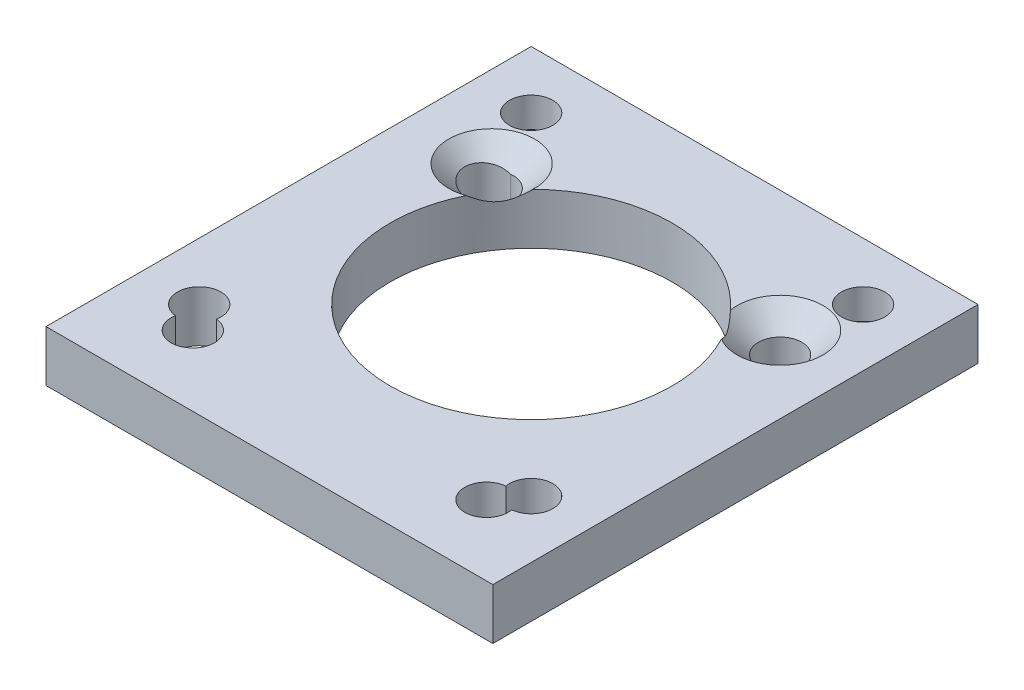
ISO-10303-21;
HEADER;
FILE_DESCRIPTION(('STEP AP214'),'2;1');
FILE_NAME('part.step','',(''),(''),'','','');
FILE_SCHEMA(('AUTOMOTIVE_DESIGN { 1 0 10303 214 1 1 1 1 }'));
ENDSEC;
DATA;
#1=APPLICATION_CONTEXT('core data for automotive mechanical design processes');
#2=APPLICATION_PROTOCOL_DEFINITION('international standard','automotive_design',2000,#1);
#3=PRODUCT_CONTEXT('',#1,'mechanical');
#4=PRODUCT('Part','Part','',(#3));
#5=PRODUCT_RELATED_PRODUCT_CATEGORY('part','',(#4));
#6=PRODUCT_DEFINITION_FORMATION('','',#4);
#7=PRODUCT_DEFINITION_CONTEXT('part definition',#1,'design');
#8=PRODUCT_DEFINITION('design','',#6,#7);
#9=PRODUCT_DEFINITION_SHAPE('','',#8);
#10=(LENGTH_UNIT() NAMED_UNIT(*) SI_UNIT(.MILLI.,.METRE.));
#11=(NAMED_UNIT(*) PLANE_ANGLE_UNIT() SI_UNIT($,.RADIAN.));
#12=(NAMED_UNIT(*) SI_UNIT($,.STERADIAN.) SOLID_ANGLE_UNIT());
#13=UNCERTAINTY_MEASURE_WITH_UNIT(LENGTH_MEASURE(1.E-05),#10,'distance_accuracy_value','');
#14=(GEOMETRIC_REPRESENTATION_CONTEXT(3) GLOBAL_UNCERTAINTY_ASSIGNED_CONTEXT((#13)) GLOBAL_UNIT_ASSIGNED_CONTEXT((#10,
#11,#12)) REPRESENTATION_CONTEXT('',''));
#15=CARTESIAN_POINT('',(0.,0.,0.));
#16=DIRECTION('',(0.,0.,1.));
#17=DIRECTION('',(1.,0.,0.));
#18=AXIS2_PLACEMENT_3D('',#15,#16,#17);
#19=CARTESIAN_POINT('',(17.5,4.,19.));
#20=DIRECTION('',(-1.,0.,0.));
#21=DIRECTION('',(0.,0.,1.));
#22=AXIS2_PLACEMENT_3D('',#19,#20,#21);
#23=PLANE('',#22);
#24=DIRECTION('',(0.,0.,-1.));
#25=VECTOR('',#24,1.);
#26=CARTESIAN_POINT('',(17.5,0.,19.));
#27=LINE('',#26,#25);
#28=CARTESIAN_POINT('',(17.5,0.,19.));
#29=VERTEX_POINT('',#28);
#30=CARTESIAN_POINT('',(17.5,0.,-19.));
#31=VERTEX_POINT('',#30);
#32=EDGE_CURVE('E208',#29,#31,#27,.T.);
#33=ORIENTED_EDGE('',*,*,#32,.T.);
#34=DIRECTION('',(0.,-1.,0.));
#35=VECTOR('',#34,1.);
#36=CARTESIAN_POINT('',(17.5,4.,-19.));
#37=LINE('',#36,#35);
#38=CARTESIAN_POINT('',(17.5,4.,-19.));
#39=VERTEX_POINT('',#38);
#40=EDGE_CURVE('E246',#39,#31,#37,.T.);
#41=ORIENTED_EDGE('',*,*,#40,.F.);
#42=DIRECTION('',(0.,0.,-1.));
#43=VECTOR('',#42,1.);
#44=CARTESIAN_POINT('',(17.5,4.,19.));
#45=LINE('',#44,#43);
#46=CARTESIAN_POINT('',(17.5,4.,19.));
#47=VERTEX_POINT('',#46);
#48=EDGE_CURVE('E209',#47,#39,#45,.T.);
#49=ORIENTED_EDGE('',*,*,#48,.F.);
#50=DIRECTION('',(0.,-1.,0.));
#51=VECTOR('',#50,1.);
#52=CARTESIAN_POINT('',(17.5,4.,19.));
#53=LINE('',#52,#51);
#54=EDGE_CURVE('E223',#47,#29,#53,.T.);
#55=ORIENTED_EDGE('',*,*,#54,.T.);
#56=EDGE_LOOP('',(#33,#41,#49,#55));
#57=FACE_BOUND('',#56,.T.);
#58=ADVANCED_FACE('F41',(#57),#23,.F.);
#59=CARTESIAN_POINT('',(-17.5,4.,-19.));
#60=DIRECTION('',(0.,0.,1.));
#61=DIRECTION('',(1.,0.,0.));
#62=AXIS2_PLACEMENT_3D('',#59,#60,#61);
#63=PLANE('',#62);
#64=DIRECTION('',(-1.,0.,0.));
#65=VECTOR('',#64,1.);
#66=CARTESIAN_POINT('',(-17.5,0.,-19.));
#67=LINE('',#66,#65);
#68=CARTESIAN_POINT('',(-17.5,0.,-19.));
#69=VERTEX_POINT('',#68);
#70=EDGE_CURVE('E227',#31,#69,#67,.T.);
#71=ORIENTED_EDGE('',*,*,#70,.T.);
#72=DIRECTION('',(0.,-1.,0.));
#73=VECTOR('',#72,1.);
#74=CARTESIAN_POINT('',(-17.5,4.,-19.));
#75=LINE('',#74,#73);
#76=CARTESIAN_POINT('',(-17.5,4.,-19.));
#77=VERTEX_POINT('',#76);
#78=EDGE_CURVE('E242',#77,#69,#75,.T.);
#79=ORIENTED_EDGE('',*,*,#78,.F.);
#80=DIRECTION('',(-1.,0.,0.));
#81=VECTOR('',#80,1.);
#82=CARTESIAN_POINT('',(-17.5,4.,-19.));
#83=LINE('',#82,#81);
#84=EDGE_CURVE('E213',#39,#77,#83,.T.);
#85=ORIENTED_EDGE('',*,*,#84,.F.);
#86=ORIENTED_EDGE('',*,*,#40,.T.);
#87=EDGE_LOOP('',(#71,#79,#85,#86));
#88=FACE_BOUND('',#87,.T.);
#89=ADVANCED_FACE('F317',(#88),#63,.F.);
#90=CARTESIAN_POINT('',(-17.5,4.,19.));
#91=DIRECTION('',(1.,0.,0.));
#92=DIRECTION('',(0.,0.,-1.));
#93=AXIS2_PLACEMENT_3D('',#90,#91,#92);
#94=PLANE('',#93);
#95=DIRECTION('',(0.,0.,1.));
#96=VECTOR('',#95,1.);
#97=CARTESIAN_POINT('',(-17.5,0.,19.));
#98=LINE('',#97,#96);
#99=CARTESIAN_POINT('',(-17.5,0.,19.));
#100=VERTEX_POINT('',#99);
#101=EDGE_CURVE('E230',#69,#100,#98,.T.);
#102=ORIENTED_EDGE('',*,*,#101,.T.);
#103=DIRECTION('',(0.,-1.,0.));
#104=VECTOR('',#103,1.);
#105=CARTESIAN_POINT('',(-17.5,4.,19.));
#106=LINE('',#105,#104);
#107=CARTESIAN_POINT('',(-17.5,4.,19.));
#108=VERTEX_POINT('',#107);
#109=EDGE_CURVE('E238',#108,#100,#106,.T.);
#110=ORIENTED_EDGE('',*,*,#109,.F.);
#111=DIRECTION('',(0.,0.,1.));
#112=VECTOR('',#111,1.);
#113=CARTESIAN_POINT('',(-17.5,4.,19.));
#114=LINE('',#113,#112);
#115=EDGE_CURVE('E217',#77,#108,#114,.T.);
#116=ORIENTED_EDGE('',*,*,#115,.F.);
#117=ORIENTED_EDGE('',*,*,#78,.T.);
#118=EDGE_LOOP('',(#102,#110,#116,#117));
#119=FACE_BOUND('',#118,.T.);
#120=ADVANCED_FACE('F314',(#119),#94,.F.);
#121=CARTESIAN_POINT('',(-17.5,4.,19.));
#122=DIRECTION('',(0.,0.,-1.));
#123=DIRECTION('',(-1.,0.,0.));
#124=AXIS2_PLACEMENT_3D('',#121,#122,#123);
#125=PLANE('',#124);
#126=DIRECTION('',(1.,0.,0.));
#127=VECTOR('',#126,1.);
#128=CARTESIAN_POINT('',(-17.5,0.,19.));
#129=LINE('',#128,#127);
#130=EDGE_CURVE('E214',#100,#29,#129,.T.);
#131=ORIENTED_EDGE('',*,*,#130,.T.);
#132=ORIENTED_EDGE('',*,*,#54,.F.);
#133=DIRECTION('',(1.,0.,0.));
#134=VECTOR('',#133,1.);
#135=CARTESIAN_POINT('',(-17.5,4.,19.));
#136=LINE('',#135,#134);
#137=EDGE_CURVE('E220',#108,#47,#136,.T.);
#138=ORIENTED_EDGE('',*,*,#137,.F.);
#139=ORIENTED_EDGE('',*,*,#109,.T.);
#140=EDGE_LOOP('',(#131,#132,#138,#139));
#141=FACE_BOUND('',#140,.T.);
#142=ADVANCED_FACE('F307',(#141),#125,.F.);
#143=CARTESIAN_POINT('',(0.,4.,0.));
#144=DIRECTION('',(0.,-1.,0.));
#145=DIRECTION('',(0.,0.,-1.));
#146=AXIS2_PLACEMENT_3D('',#143,#144,#145);
#147=PLANE('',#146);
#148=CARTESIAN_POINT('',(-13.,4.,-14.5));
#149=DIRECTION('',(0.,1.,0.));
#150=DIRECTION('',(0.,0.,1.));
#151=AXIS2_PLACEMENT_3D('',#148,#149,#150);
#152=CIRCLE('',#151,1.69999999999999);
#153=CARTESIAN_POINT('',(-13.,4.,-12.8));
#154=VERTEX_POINT('',#153);
#155=EDGE_CURVE('E551',#154,#154,#152,.T.);
#156=ORIENTED_EDGE('',*,*,#155,.F.);
#157=EDGE_LOOP('',(#156));
#158=FACE_BOUND('',#157,.T.);
#159=CARTESIAN_POINT('',(13.,4.,-14.5));
#160=DIRECTION('',(0.,1.,0.));
#161=DIRECTION('',(0.,0.,1.));
#162=AXIS2_PLACEMENT_3D('',#159,#160,#161);
#163=CIRCLE('',#162,1.69999999999999);
#164=CARTESIAN_POINT('',(13.,4.,-12.8));
#165=VERTEX_POINT('',#164);
#166=EDGE_CURVE('E547',#165,#165,#163,.T.);
#167=ORIENTED_EDGE('',*,*,#166,.F.);
#168=EDGE_LOOP('',(#167));
#169=FACE_BOUND('',#168,.T.);
#170=CARTESIAN_POINT('',(0.,4.,-1.5));
#171=DIRECTION('',(0.,1.,0.));
#172=DIRECTION('',(0.,0.,1.));
#173=AXIS2_PLACEMENT_3D('',#170,#171,#172);
#174=CIRCLE('',#173,11.05);
#175=CARTESIAN_POINT('',(8.19098442890587,4.,-8.91689113344811));
#176=VERTEX_POINT('',#175);
#177=CARTESIAN_POINT('',(-7.73496340737816,4.,-9.39131428131724));
#178=VERTEX_POINT('',#177);
#179=EDGE_CURVE('E166',#176,#178,#174,.T.);
#180=ORIENTED_EDGE('',*,*,#179,.F.);
#181=CARTESIAN_POINT('',(11.5000000000009,4.,-9.4999999999995));
#182=DIRECTION('',(0.,1.,0.));
#183=DIRECTION('',(0.,0.,1.));
#184=AXIS2_PLACEMENT_3D('',#181,#182,#183);
#185=CIRCLE('',#184,3.36);
#186=CARTESIAN_POINT('',(9.80251034816513,4.,-6.6003226245126));
#187=VERTEX_POINT('',#186);
#188=EDGE_CURVE('E64',#187,#176,#185,.T.);
#189=ORIENTED_EDGE('',*,*,#188,.F.);
#190=CARTESIAN_POINT('',(-9.92979890441477,4.,-6.34784423407806));
#191=VERTEX_POINT('',#190);
#192=EDGE_CURVE('E165',#191,#187,#174,.T.);
#193=ORIENTED_EDGE('',*,*,#192,.F.);
#194=CARTESIAN_POINT('',(-11.0932051221084,4.,-9.4999999999995));
#195=DIRECTION('',(0.,1.,0.));
#196=DIRECTION('',(0.,0.,1.));
#197=AXIS2_PLACEMENT_3D('',#194,#195,#196);
#198=CIRCLE('',#197,3.36);
#199=EDGE_CURVE('E495',#178,#191,#198,.T.);
#200=ORIENTED_EDGE('',*,*,#199,.F.);
#201=EDGE_LOOP('',(#180,#189,#193,#200));
#202=FACE_BOUND('',#201,.T.);
#203=CARTESIAN_POINT('',(11.5000000000009,4.,13.5000000000005));
#204=DIRECTION('',(0.,-1.,0.));
#205=DIRECTION('',(0.,0.,-1.));
#206=AXIS2_PLACEMENT_3D('',#203,#204,#205);
#207=CIRCLE('',#206,1.7);
#208=CARTESIAN_POINT('',(13.171737489745,4.,13.1913031173081));
#209=VERTEX_POINT('',#208);
#210=CARTESIAN_POINT('',(11.3282625102559,4.,11.8086968826924));
#211=VERTEX_POINT('',#210);
#212=EDGE_CURVE('E188',#209,#211,#207,.T.);
#213=ORIENTED_EDGE('',*,*,#212,.T.);
#214=CARTESIAN_POINT('',(13.,4.,11.5));
#215=DIRECTION('',(0.,1.,0.));
#216=DIRECTION('',(0.,0.,1.));
#217=AXIS2_PLACEMENT_3D('',#214,#215,#216);
#218=CIRCLE('',#217,1.69999999999999);
#219=EDGE_CURVE('E527',#209,#211,#218,.T.);
#220=ORIENTED_EDGE('',*,*,#219,.F.);
#221=EDGE_LOOP('',(#213,#220));
#222=FACE_BOUND('',#221,.T.);
#223=CARTESIAN_POINT('',(-11.4999999999991,4.,13.5000000000005));
#224=DIRECTION('',(0.,-1.,0.));
#225=DIRECTION('',(0.,0.,-1.));
#226=AXIS2_PLACEMENT_3D('',#223,#224,#225);
#227=CIRCLE('',#226,1.7);
#228=CARTESIAN_POINT('',(-11.3282625102559,4.,11.8086968826922));
#229=VERTEX_POINT('',#228);
#230=CARTESIAN_POINT('',(-13.1717374897433,4.,13.1913031173083));
#231=VERTEX_POINT('',#230);
#232=EDGE_CURVE('E204',#229,#231,#227,.T.);
#233=ORIENTED_EDGE('',*,*,#232,.T.);
#234=CARTESIAN_POINT('',(-13.,4.,11.5));
#235=DIRECTION('',(0.,1.,0.));
#236=DIRECTION('',(0.,0.,1.));
#237=AXIS2_PLACEMENT_3D('',#234,#235,#236);
#238=CIRCLE('',#237,1.69999999999999);
#239=EDGE_CURVE('E544',#229,#231,#238,.T.);
#240=ORIENTED_EDGE('',*,*,#239,.F.);
#241=EDGE_LOOP('',(#233,#240));
#242=FACE_BOUND('',#241,.T.);
#243=ORIENTED_EDGE('',*,*,#48,.T.);
#244=ORIENTED_EDGE('',*,*,#84,.T.);
#245=ORIENTED_EDGE('',*,*,#115,.T.);
#246=ORIENTED_EDGE('',*,*,#137,.T.);
#247=EDGE_LOOP('',(#243,#244,#245,#246));
#248=FACE_BOUND('',#247,.T.);
#249=ADVANCED_FACE('F162',(#158,#169,#202,#222,#242,#248),#147,.F.);
#250=CARTESIAN_POINT('',(0.,0.,0.));
#251=DIRECTION('',(0.,-1.,0.));
#252=DIRECTION('',(0.,0.,-1.));
#253=AXIS2_PLACEMENT_3D('',#250,#251,#252);
#254=PLANE('',#253);
#255=CARTESIAN_POINT('',(-11.0932051221084,0.,-9.4999999999995));
#256=DIRECTION('',(0.,1.,0.));
#257=DIRECTION('',(0.,0.,1.));
#258=AXIS2_PLACEMENT_3D('',#255,#256,#257);
#259=CIRCLE('',#258,1.7);
#260=CARTESIAN_POINT('',(-11.2966025610538,0.,-7.81221165964682));
#261=VERTEX_POINT('',#260);
#262=CARTESIAN_POINT('',(-11.2966025610537,0.,-11.1877883403522));
#263=VERTEX_POINT('',#262);
#264=EDGE_CURVE('E290',#261,#263,#259,.T.);
#265=ORIENTED_EDGE('',*,*,#264,.T.);
#266=CARTESIAN_POINT('',(-11.4999999999991,0.,-9.49999999999951));
#267=DIRECTION('',(0.,-1.,0.));
#268=DIRECTION('',(0.,0.,-1.));
#269=AXIS2_PLACEMENT_3D('',#266,#267,#268);
#270=CIRCLE('',#269,1.7);
#271=EDGE_CURVE('E196',#261,#263,#270,.T.);
#272=ORIENTED_EDGE('',*,*,#271,.F.);
#273=EDGE_LOOP('',(#265,#272));
#274=FACE_BOUND('',#273,.T.);
#275=CARTESIAN_POINT('',(13.,0.,-14.5));
#276=DIRECTION('',(0.,-1.,0.));
#277=DIRECTION('',(0.,0.,-1.));
#278=AXIS2_PLACEMENT_3D('',#275,#276,#277);
#279=CIRCLE('',#278,3.36);
#280=CARTESIAN_POINT('',(13.,0.,-17.86));
#281=VERTEX_POINT('',#280);
#282=EDGE_CURVE('E289',#281,#281,#279,.T.);
#283=ORIENTED_EDGE('',*,*,#282,.F.);
#284=EDGE_LOOP('',(#283));
#285=FACE_BOUND('',#284,.T.);
#286=CARTESIAN_POINT('',(-13.,0.,-14.5));
#287=DIRECTION('',(0.,-1.,0.));
#288=DIRECTION('',(0.,0.,-1.));
#289=AXIS2_PLACEMENT_3D('',#286,#287,#288);
#290=CIRCLE('',#289,3.36);
#291=CARTESIAN_POINT('',(-13.,0.,-17.86));
#292=VERTEX_POINT('',#291);
#293=EDGE_CURVE('E514',#292,#292,#290,.T.);
#294=ORIENTED_EDGE('',*,*,#293,.F.);
#295=EDGE_LOOP('',(#294));
#296=FACE_BOUND('',#295,.T.);
#297=CARTESIAN_POINT('',(-13.,0.,11.5));
#298=DIRECTION('',(0.,1.,0.));
#299=DIRECTION('',(0.,0.,1.));
#300=AXIS2_PLACEMENT_3D('',#297,#298,#299);
#301=CIRCLE('',#300,1.7);
#302=CARTESIAN_POINT('',(-11.3282625102559,0.,11.8086968826922));
#303=VERTEX_POINT('',#302);
#304=CARTESIAN_POINT('',(-13.1717374897433,0.,13.1913031173083));
#305=VERTEX_POINT('',#304);
#306=EDGE_CURVE('E518',#303,#305,#301,.T.);
#307=ORIENTED_EDGE('',*,*,#306,.T.);
#308=CARTESIAN_POINT('',(-11.4999999999991,0.,13.5000000000005));
#309=DIRECTION('',(0.,-1.,0.));
#310=DIRECTION('',(0.,0.,-1.));
#311=AXIS2_PLACEMENT_3D('',#308,#309,#310);
#312=CIRCLE('',#311,1.7);
#313=EDGE_CURVE('E200',#303,#305,#312,.T.);
#314=ORIENTED_EDGE('',*,*,#313,.F.);
#315=EDGE_LOOP('',(#307,#314));
#316=FACE_BOUND('',#315,.T.);
#317=CARTESIAN_POINT('',(13.,0.,11.5));
#318=DIRECTION('',(0.,1.,0.));
#319=DIRECTION('',(0.,0.,1.));
#320=AXIS2_PLACEMENT_3D('',#317,#318,#319);
#321=CIRCLE('',#320,1.7);
#322=CARTESIAN_POINT('',(13.171737489745,0.,13.1913031173081));
#323=VERTEX_POINT('',#322);
#324=CARTESIAN_POINT('',(11.3282625102559,0.,11.8086968826924));
#325=VERTEX_POINT('',#324);
#326=EDGE_CURVE('E182',#323,#325,#321,.T.);
#327=ORIENTED_EDGE('',*,*,#326,.T.);
#328=CARTESIAN_POINT('',(11.5000000000009,0.,13.5000000000005));
#329=DIRECTION('',(0.,-1.,0.));
#330=DIRECTION('',(0.,0.,-1.));
#331=AXIS2_PLACEMENT_3D('',#328,#329,#330);
#332=CIRCLE('',#331,1.7);
#333=EDGE_CURVE('E179',#323,#325,#332,.T.);
#334=ORIENTED_EDGE('',*,*,#333,.F.);
#335=EDGE_LOOP('',(#327,#334));
#336=FACE_BOUND('',#335,.T.);
#337=CARTESIAN_POINT('',(0.,0.,-1.5));
#338=DIRECTION('',(0.,1.,0.));
#339=DIRECTION('',(0.,0.,1.));
#340=AXIS2_PLACEMENT_3D('',#337,#338,#339);
#341=CIRCLE('',#340,11.05);
#342=CARTESIAN_POINT('',(0.,0.,9.55));
#343=VERTEX_POINT('',#342);
#344=EDGE_CURVE('E175',#343,#343,#341,.T.);
#345=ORIENTED_EDGE('',*,*,#344,.T.);
#346=EDGE_LOOP('',(#345));
#347=FACE_BOUND('',#346,.T.);
#348=CARTESIAN_POINT('',(11.5000000000009,0.,-9.4999999999995));
#349=DIRECTION('',(0.,-1.,0.));
#350=DIRECTION('',(0.,0.,-1.));
#351=AXIS2_PLACEMENT_3D('',#348,#349,#350);
#352=CIRCLE('',#351,1.7);
#353=CARTESIAN_POINT('',(11.5000000000009,0.,-11.1999999999995));
#354=VERTEX_POINT('',#353);
#355=EDGE_CURVE('E192',#354,#354,#352,.T.);
#356=ORIENTED_EDGE('',*,*,#355,.F.);
#357=EDGE_LOOP('',(#356));
#358=FACE_BOUND('',#357,.T.);
#359=ORIENTED_EDGE('',*,*,#32,.F.);
#360=ORIENTED_EDGE('',*,*,#130,.F.);
#361=ORIENTED_EDGE('',*,*,#101,.F.);
#362=ORIENTED_EDGE('',*,*,#70,.F.);
#363=EDGE_LOOP('',(#359,#360,#361,#362));
#364=FACE_BOUND('',#363,.T.);
#365=ADVANCED_FACE('F303',(#274,#285,#296,#316,#336,#347,#358,#364),#254,.T.);
#366=CARTESIAN_POINT('',(-11.4999999999991,0.,13.5000000000005));
#367=DIRECTION('',(0.,-1.,0.));
#368=DIRECTION('',(0.,0.,-1.));
#369=AXIS2_PLACEMENT_3D('',#366,#367,#368);
#370=CYLINDRICAL_SURFACE('',#369,1.7);
#371=ORIENTED_EDGE('',*,*,#232,.F.);
#372=DIRECTION('',(0.,1.,0.));
#373=VECTOR('',#372,1.);
#374=CARTESIAN_POINT('',(-11.3282625102559,2.,11.8086968826922));
#375=LINE('',#374,#373);
#376=EDGE_CURVE('E532',#229,#303,#375,.F.);
#377=ORIENTED_EDGE('',*,*,#376,.T.);
#378=ORIENTED_EDGE('',*,*,#313,.T.);
#379=DIRECTION('',(0.,1.,0.));
#380=VECTOR('',#379,1.);
#381=CARTESIAN_POINT('',(-13.1717374897433,2.,13.1913031173083));
#382=LINE('',#381,#380);
#383=EDGE_CURVE('E536',#305,#231,#382,.T.);
#384=ORIENTED_EDGE('',*,*,#383,.T.);
#385=EDGE_LOOP('',(#371,#377,#378,#384));
#386=FACE_BOUND('',#385,.T.);
#387=ADVANCED_FACE('F299',(#386),#370,.F.);
#388=CARTESIAN_POINT('',(-11.4999999999991,0.,-9.49999999999951));
#389=DIRECTION('',(0.,-1.,0.));
#390=DIRECTION('',(0.,0.,-1.));
#391=AXIS2_PLACEMENT_3D('',#388,#389,#390);
#392=CYLINDRICAL_SURFACE('',#391,1.7);
#393=CARTESIAN_POINT('',(-11.295766808151,2.3398,-11.1876874128066));
#394=CARTESIAN_POINT('',(-11.3769435297496,2.35923386011612,-11.1975422479411));
#395=CARTESIAN_POINT('',(-11.4588556876648,2.3784971273749,-11.2014805199244));
#396=CARTESIAN_POINT('',(-11.6226390256236,2.41640469275714,-11.1975426573075));
#397=CARTESIAN_POINT('',(-11.7045100481313,2.43504824758629,-11.1896528239303));
#398=CARTESIAN_POINT('',(-11.8822905738589,2.47493402727359,-11.15936515754));
#399=CARTESIAN_POINT('',(-11.9778260765855,2.49597450029165,-11.1344393247334));
#400=CARTESIAN_POINT('',(-12.1634683070028,2.53622740234881,-11.0682856291321));
#401=CARTESIAN_POINT('',(-12.2535755335449,2.55543999946156,-11.0270592669761));
#402=CARTESIAN_POINT('',(-12.42431747866,2.59136248851555,-10.9300807795328));
#403=CARTESIAN_POINT('',(-12.5050737190208,2.60810551520164,-10.8745551378416));
#404=CARTESIAN_POINT('',(-12.6561355348144,2.63908539382363,-10.7501685735584));
#405=CARTESIAN_POINT('',(-12.7264412675096,2.65332228347325,-10.6813078516727));
#406=CARTESIAN_POINT('',(-12.8530002803352,2.67873186056636,-10.5337509384334));
#407=CARTESIAN_POINT('',(-12.9095160427177,2.68996225910394,-10.4552898114581));
#408=CARTESIAN_POINT('',(-13.0085556627834,2.70952251241598,-10.2896622000577));
#409=CARTESIAN_POINT('',(-13.0510817083276,2.71785282074932,-10.2024970796379));
#410=CARTESIAN_POINT('',(-13.1201136064101,2.73132363808319,-10.0236853951301));
#411=CARTESIAN_POINT('',(-13.1469029875263,2.73652064831551,-9.93215248350289));
#412=CARTESIAN_POINT('',(-13.1848243720308,2.74386585631145,-9.74578025783802));
#413=CARTESIAN_POINT('',(-13.1959573208964,2.74601423817896,-9.65094114381334));
#414=CARTESIAN_POINT('',(-13.2021731369481,2.74721451778811,-9.46179983660357));
#415=CARTESIAN_POINT('',(-13.1974365267925,2.74630124304269,-9.36750374515175));
#416=CARTESIAN_POINT('',(-13.1724616477346,2.74147222476038,-9.18106930246528));
#417=CARTESIAN_POINT('',(-13.1522238348953,2.73755656955697,-9.08893088783149));
#418=CARTESIAN_POINT('',(-13.0969226352395,2.72680393803527,-8.9095466549011));
#419=CARTESIAN_POINT('',(-13.0618806431002,2.71997117730446,-8.82229398111603));
#420=CARTESIAN_POINT('',(-12.9780557263421,2.7035117136212,-8.65494967927834));
#421=CARTESIAN_POINT('',(-12.9292722494791,2.69388489838053,-8.57485833919662));
#422=CARTESIAN_POINT('',(-12.8189621291299,2.67191966975403,-8.42334036001924));
#423=CARTESIAN_POINT('',(-12.7573290412536,2.65955854998551,-8.35199455014296));
#424=CARTESIAN_POINT('',(-12.6234301661542,2.63240492123326,-8.22066418907279));
#425=CARTESIAN_POINT('',(-12.5511645429954,2.61761244976584,-8.16067946260554));
#426=CARTESIAN_POINT('',(-12.3968343461164,2.58560972449206,-8.05269127144185));
#427=CARTESIAN_POINT('',(-12.314628712663,2.56836385135555,-8.00490004534788));
#428=CARTESIAN_POINT('',(-12.143722175164,2.53196689029504,-7.92374639462564));
#429=CARTESIAN_POINT('',(-12.0550176785086,2.51281474644378,-7.89039202222858));
#430=CARTESIAN_POINT('',(-11.8717094416035,2.47257050447998,-7.83834200117828));
#431=CARTESIAN_POINT('',(-11.7770203885893,2.45144582572496,-7.8199729834444));
#432=CARTESIAN_POINT('',(-11.5862983281626,2.40809507612885,-7.7994945731492));
#433=CARTESIAN_POINT('',(-11.4902682446599,2.38587119399453,-7.79735408239832));
#434=CARTESIAN_POINT('',(-11.3617588633789,2.3555388044854,-7.80530148195405));
#435=CARTESIAN_POINT('',(-11.3286925080047,2.34768062740306,-7.80832253312699));
#436=CARTESIAN_POINT('',(-11.2957668081511,2.3398,-7.81231258719239));
#437=B_SPLINE_CURVE_WITH_KNOTS('',3,(#393,#394,#395,#396,#397,#398,#399,#400,#401,#402,#403,
#404,#405,#406,#407,#408,#409,#410,#411,#412,#413,#414,#415,#416,#417,#418,#419,#420,#421,#422,
#423,#424,#425,#426,#427,#428,#429,#430,#431,#432,#433,#434,#435,#436),.UNSPECIFIED.,.F.,.F.,(4,
2,2,2,2,2,2,2,2,2,2,2,2,2,2,2,2,2,2,2,2,4),(0.,0.251901631685151,0.50409522992525,
0.805443433036339,1.10676390026995,1.40357753771348,1.70038670816269,1.99100601682614,
2.28157985371504,2.56674367773059,2.85189028023021,3.13380428809017,3.41571000203513,
3.69720969815915,3.97872070883687,4.26266362211572,4.54660215450226,4.83518938831324,
5.12393737640472,5.4188225426612,5.7131424870559,5.81544525073404),.UNSPECIFIED.);
#438=CARTESIAN_POINT('',(-11.2966025610537,2.34,-11.1877883403522));
#439=VERTEX_POINT('',#438);
#440=CARTESIAN_POINT('',(-11.2966025610538,2.34,-7.81221165964682));
#441=VERTEX_POINT('',#440);
#442=EDGE_CURVE('E279',#439,#441,#437,.T.);
#443=ORIENTED_EDGE('',*,*,#442,.T.);
#444=DIRECTION('',(0.,1.,0.));
#445=VECTOR('',#444,1.);
#446=CARTESIAN_POINT('',(-11.2966025610538,1.17,-7.81221165964682));
#447=LINE('',#446,#445);
#448=EDGE_CURVE('E55',#441,#261,#447,.F.);
#449=ORIENTED_EDGE('',*,*,#448,.T.);
#450=ORIENTED_EDGE('',*,*,#271,.T.);
#451=DIRECTION('',(0.,1.,0.));
#452=VECTOR('',#451,1.);
#453=CARTESIAN_POINT('',(-11.2966025610537,1.17,-11.1877883403522));
#454=LINE('',#453,#452);
#455=EDGE_CURVE('E265',#263,#439,#454,.T.);
#456=ORIENTED_EDGE('',*,*,#455,.T.);
#457=EDGE_LOOP('',(#443,#449,#450,#456));
#458=FACE_BOUND('',#457,.T.);
#459=ADVANCED_FACE('F293',(#458),#392,.F.);
#460=CARTESIAN_POINT('',(11.5000000000009,0.,-9.4999999999995));
#461=DIRECTION('',(0.,-1.,0.));
#462=DIRECTION('',(0.,0.,-1.));
#463=AXIS2_PLACEMENT_3D('',#460,#461,#462);
#464=CYLINDRICAL_SURFACE('',#463,1.7);
#465=CARTESIAN_POINT('',(11.5000000000009,2.34,-9.4999999999995));
#466=DIRECTION('',(0.,1.,0.));
#467=DIRECTION('',(0.,0.,1.));
#468=AXIS2_PLACEMENT_3D('',#465,#466,#467);
#469=CIRCLE('',#468,1.7);
#470=CARTESIAN_POINT('',(11.5000000000009,2.34,-7.79999999999949));
#471=VERTEX_POINT('',#470);
#472=EDGE_CURVE('E168',#471,#471,#469,.T.);
#473=ORIENTED_EDGE('',*,*,#472,.T.);
#474=EDGE_LOOP('',(#473));
#475=FACE_BOUND('',#474,.T.);
#476=ORIENTED_EDGE('',*,*,#355,.T.);
#477=EDGE_LOOP('',(#476));
#478=FACE_BOUND('',#477,.T.);
#479=ADVANCED_FACE('F298',(#475,#478),#464,.F.);
#480=CARTESIAN_POINT('',(11.5000000000009,0.,13.5000000000005));
#481=DIRECTION('',(0.,-1.,0.));
#482=DIRECTION('',(0.,0.,-1.));
#483=AXIS2_PLACEMENT_3D('',#480,#481,#482);
#484=CYLINDRICAL_SURFACE('',#483,1.7);
#485=ORIENTED_EDGE('',*,*,#212,.F.);
#486=DIRECTION('',(0.,1.,0.));
#487=VECTOR('',#486,1.);
#488=CARTESIAN_POINT('',(13.171737489745,2.,13.1913031173081));
#489=LINE('',#488,#487);
#490=EDGE_CURVE('E254',#209,#323,#489,.F.);
#491=ORIENTED_EDGE('',*,*,#490,.T.);
#492=ORIENTED_EDGE('',*,*,#333,.T.);
#493=DIRECTION('',(0.,1.,0.));
#494=VECTOR('',#493,1.);
#495=CARTESIAN_POINT('',(11.3282625102559,2.,11.8086968826924));
#496=LINE('',#495,#494);
#497=EDGE_CURVE('E250',#325,#211,#496,.T.);
#498=ORIENTED_EDGE('',*,*,#497,.T.);
#499=EDGE_LOOP('',(#485,#491,#492,#498));
#500=FACE_BOUND('',#499,.T.);
#501=ADVANCED_FACE('F370',(#500),#484,.F.);
#502=CARTESIAN_POINT('',(0.,0.,-1.5));
#503=DIRECTION('',(0.,1.,0.));
#504=DIRECTION('',(0.,0.,1.));
#505=AXIS2_PLACEMENT_3D('',#502,#503,#504);
#506=CYLINDRICAL_SURFACE('',#505,11.05);
#507=ORIENTED_EDGE('',*,*,#344,.F.);
#508=EDGE_LOOP('',(#507));
#509=FACE_BOUND('',#508,.T.);
#510=ORIENTED_EDGE('',*,*,#192,.T.);
#511=CARTESIAN_POINT('',(9.80268372112116,4.00020000000173,-6.59998939838757));
#512=CARTESIAN_POINT('',(9.76905478248528,3.96142228423356,-6.66462373980354));
#513=CARTESIAN_POINT('',(9.73433073736992,3.92438452650854,-6.7298089327933));
#514=CARTESIAN_POINT('',(9.66244295853411,3.85465485576738,-6.86146909781175));
#515=CARTESIAN_POINT('',(9.6252717763367,3.82197722261938,-6.92794752847512));
#516=CARTESIAN_POINT('',(9.54816123424158,3.76186644732645,-7.06247861663742));
#517=CARTESIAN_POINT('',(9.50820295515945,3.73447512386639,-7.13053940563223));
#518=CARTESIAN_POINT('',(9.4257975183354,3.68645885993549,-7.2674264699751));
#519=CARTESIAN_POINT('',(9.38335417359012,3.66582385772771,-7.33625144775756));
#520=CARTESIAN_POINT('',(9.30419055140788,3.63549762161936,-7.46145604740618));
#521=CARTESIAN_POINT('',(9.26787380134565,3.62448484967702,-7.51776989671953));
#522=CARTESIAN_POINT('',(9.19382316126686,3.60812085060469,-7.63030588755816));
#523=CARTESIAN_POINT('',(9.15608921667905,3.60276984172146,-7.68652802546478));
#524=CARTESIAN_POINT('',(9.07966685145917,3.59799905608207,-7.79815061564022));
#525=CARTESIAN_POINT('',(9.04098435353013,3.59854884761318,-7.85355380958445));
#526=CARTESIAN_POINT('',(8.96278835919965,3.60547884833064,-7.96339466141958));
#527=CARTESIAN_POINT('',(8.92327486876135,3.6118590156926,-8.01783232623388));
#528=CARTESIAN_POINT('',(8.84390367931308,3.63011251934602,-8.12512649312641));
#529=CARTESIAN_POINT('',(8.8040483360257,3.64196095457543,-8.17798901841087));
#530=CARTESIAN_POINT('',(8.72406725115468,3.6706542739751,-8.28214337202923));
#531=CARTESIAN_POINT('',(8.68394139059076,3.68750151878672,-8.33343444560575));
#532=CARTESIAN_POINT('',(8.56319814481086,3.74478258209334,-8.48504487074064));
#533=CARTESIAN_POINT('',(8.48245267055992,3.79189509818347,-8.58278152892762));
#534=CARTESIAN_POINT('',(8.36660924347649,3.86902493344198,-8.71840283482958));
#535=CARTESIAN_POINT('',(8.33123707891261,3.8938676732052,-8.75919136483646));
#536=CARTESIAN_POINT('',(8.26080625326292,3.94557686517788,-8.83923657449856));
#537=CARTESIAN_POINT('',(8.22574695701132,3.97243090991974,-8.87850069057652));
#538=CARTESIAN_POINT('',(8.19073229691948,4.0002,-8.91716957067854));
#539=B_SPLINE_CURVE_WITH_KNOTS('',3,(#511,#512,#513,#514,#515,#516,#517,#518,#519,#520,#521,
#522,#523,#524,#525,#526,#527,#528,#529,#530,#531,#532,#533,#534,#535,#536,#537,#538),
.UNSPECIFIED.,.F.,.F.,(4,2,2,2,2,2,2,2,2,2,2,2,2,4),(0.,0.247671821306722,0.496135862692501,
0.746491393847962,0.996472373269981,1.19996563507726,1.40346674075335,1.60591885333034,
1.8083695136213,2.00990722731714,2.21154026721312,2.61600396558671,2.79426984947686,
2.97151458369148),.UNSPECIFIED.);
#540=EDGE_CURVE('E11',#187,#176,#539,.T.);
#541=ORIENTED_EDGE('',*,*,#540,.T.);
#542=ORIENTED_EDGE('',*,*,#179,.T.);
#543=CARTESIAN_POINT('',(-7.73475675374496,4.00020000000091,-9.39151683520964));
#544=CARTESIAN_POINT('',(-7.79499124682381,3.94196725977727,-9.33246699971387));
#545=CARTESIAN_POINT('',(-7.85534474322419,3.88519743815242,-9.27197130612002));
#546=CARTESIAN_POINT('',(-7.97669012464953,3.77565108203574,-9.14738900832171));
#547=CARTESIAN_POINT('',(-8.03768363332055,3.72289256694329,-9.08328821996996));
#548=CARTESIAN_POINT('',(-8.16192435878796,3.62154691947016,-8.94943298287503));
#549=CARTESIAN_POINT('',(-8.22518667163749,3.57311909839436,-8.8795701556471));
#550=CARTESIAN_POINT('',(-8.35222855490506,3.48433256593878,-8.73546677540692));
#551=CARTESIAN_POINT('',(-8.41600704381638,3.44396006878609,-8.66123398808921));
#552=CARTESIAN_POINT('',(-8.51876210279242,3.38764029824465,-8.53824243202968));
#553=CARTESIAN_POINT('',(-8.55763570808256,3.3683292868992,-8.49093702816944));
#554=CARTESIAN_POINT('',(-8.63537676586426,3.33427547994625,-8.39467862512345));
#555=CARTESIAN_POINT('',(-8.67424421815948,3.31953280872938,-8.3457255811146));
#556=CARTESIAN_POINT('',(-8.7513041608462,3.29536326259662,-8.24692920903045));
#557=CARTESIAN_POINT('',(-8.7894992776851,3.28587731081881,-8.19710255071677));
#558=CARTESIAN_POINT('',(-8.86537997480323,3.27240867648106,-8.09632584756956));
#559=CARTESIAN_POINT('',(-8.90306559858281,3.26842552111826,-8.04537589963181));
#560=CARTESIAN_POINT('',(-8.97775694019813,3.26616139440311,-7.94254869958568));
#561=CARTESIAN_POINT('',(-9.0147594359165,3.26790270617184,-7.89066860741712));
#562=CARTESIAN_POINT('',(-9.08763043974065,3.2770452313285,-7.78661346682686));
#563=CARTESIAN_POINT('',(-9.12349885721248,3.28444689589929,-7.73443839522164));
#564=CARTESIAN_POINT('',(-9.19427957052402,3.30466424229641,-7.62958174566732));
#565=CARTESIAN_POINT('',(-9.22917561712429,3.31754269950352,-7.57690144482604));
#566=CARTESIAN_POINT('',(-9.29741642259121,3.34814746101676,-7.47197349826066));
#567=CARTESIAN_POINT('',(-9.33076125723813,3.36587352821432,-7.4197258315041));
#568=CARTESIAN_POINT('',(-9.41981367113795,3.42011835384043,-7.27762306380139));
#569=CARTESIAN_POINT('',(-9.47392568913309,3.46086863880603,-7.18837915035351));
#570=CARTESIAN_POINT('',(-9.57764410229283,3.55183836131238,-7.01196408681728));
#571=CARTESIAN_POINT('',(-9.62724006985921,3.60207892943988,-6.9247980605832));
#572=CARTESIAN_POINT('',(-9.72100849268243,3.7079377019353,-6.75486883936403));
#573=CARTESIAN_POINT('',(-9.76529231973329,3.76337083377375,-6.67205044787613));
#574=CARTESIAN_POINT('',(-9.8290176635498,3.84994723980457,-6.549259487277));
#575=CARTESIAN_POINT('',(-9.8497588455762,3.87929631462419,-6.50867244808931));
#576=CARTESIAN_POINT('',(-9.89043338193916,3.93901690281991,-6.42786672928657));
#577=CARTESIAN_POINT('',(-9.91036695926723,3.9693881296659,-6.3876479503963));
#578=CARTESIAN_POINT('',(-9.92992585220299,4.0002,-6.34758419934624));
#579=B_SPLINE_CURVE_WITH_KNOTS('',3,(#543,#544,#545,#546,#547,#548,#549,#550,#551,#552,#553,
#554,#555,#556,#557,#558,#559,#560,#561,#562,#563,#564,#565,#566,#567,#568,#569,#570,#571,#572,
#573,#574,#575,#576,#577,#578),.UNSPECIFIED.,.F.,.F.,(4,2,2,2,2,2,2,2,2,2,2,2,2,2,2,2,2,4),(0.,
0.307586715539698,0.616482222420957,0.934076591118903,1.251122681017,1.4435747268339,
1.63603201243699,1.82628010250264,2.01651184534523,2.20748496174866,2.3984733020757,
2.59171240998156,2.78494206777579,3.12032927224776,3.45647222815529,3.78340459059682,
3.94602596938172,4.10860213566851),.UNSPECIFIED.);
#580=EDGE_CURVE('E173',#178,#191,#579,.T.);
#581=ORIENTED_EDGE('',*,*,#580,.T.);
#582=EDGE_LOOP('',(#510,#541,#542,#581));
#583=FACE_BOUND('',#582,.T.);
#584=ADVANCED_FACE('F171',(#509,#583),#506,.F.);
#585=CARTESIAN_POINT('',(13.,4.,11.5));
#586=DIRECTION('',(0.,1.,0.));
#587=DIRECTION('',(0.,0.,1.));
#588=AXIS2_PLACEMENT_3D('',#585,#586,#587);
#589=CYLINDRICAL_SURFACE('',#588,1.69999999999999);
#590=ORIENTED_EDGE('',*,*,#219,.T.);
#591=ORIENTED_EDGE('',*,*,#497,.F.);
#592=ORIENTED_EDGE('',*,*,#326,.F.);
#593=ORIENTED_EDGE('',*,*,#490,.F.);
#594=EDGE_LOOP('',(#590,#591,#592,#593));
#595=FACE_BOUND('',#594,.T.);
#596=ADVANCED_FACE('F381',(#595),#589,.F.);
#597=CARTESIAN_POINT('',(-13.,4.,11.5));
#598=DIRECTION('',(0.,1.,0.));
#599=DIRECTION('',(0.,0.,1.));
#600=AXIS2_PLACEMENT_3D('',#597,#598,#599);
#601=CYLINDRICAL_SURFACE('',#600,1.69999999999999);
#602=ORIENTED_EDGE('',*,*,#239,.T.);
#603=ORIENTED_EDGE('',*,*,#383,.F.);
#604=ORIENTED_EDGE('',*,*,#306,.F.);
#605=ORIENTED_EDGE('',*,*,#376,.F.);
#606=EDGE_LOOP('',(#602,#603,#604,#605));
#607=FACE_BOUND('',#606,.T.);
#608=ADVANCED_FACE('F385',(#607),#601,.F.);
#609=CARTESIAN_POINT('',(13.,4.,-14.5));
#610=DIRECTION('',(0.,1.,0.));
#611=DIRECTION('',(0.,0.,1.));
#612=AXIS2_PLACEMENT_3D('',#609,#610,#611);
#613=CYLINDRICAL_SURFACE('',#612,1.69999999999999);
#614=CARTESIAN_POINT('',(13.,1.66,-14.5));
#615=DIRECTION('',(0.,-1.,0.));
#616=DIRECTION('',(0.,0.,-1.));
#617=AXIS2_PLACEMENT_3D('',#614,#615,#616);
#618=CIRCLE('',#617,1.7);
#619=CARTESIAN_POINT('',(13.,1.66,-16.2));
#620=VERTEX_POINT('',#619);
#621=EDGE_CURVE('E560',#620,#620,#618,.T.);
#622=ORIENTED_EDGE('',*,*,#621,.T.);
#623=EDGE_LOOP('',(#622));
#624=FACE_BOUND('',#623,.T.);
#625=ORIENTED_EDGE('',*,*,#166,.T.);
#626=EDGE_LOOP('',(#625));
#627=FACE_BOUND('',#626,.T.);
#628=ADVANCED_FACE('F392',(#624,#627),#613,.F.);
#629=CARTESIAN_POINT('',(-13.,4.,-14.5));
#630=DIRECTION('',(0.,1.,0.));
#631=DIRECTION('',(0.,0.,1.));
#632=AXIS2_PLACEMENT_3D('',#629,#630,#631);
#633=CYLINDRICAL_SURFACE('',#632,1.69999999999999);
#634=CARTESIAN_POINT('',(-13.,1.66,-14.5));
#635=DIRECTION('',(0.,-1.,0.));
#636=DIRECTION('',(0.,0.,-1.));
#637=AXIS2_PLACEMENT_3D('',#634,#635,#636);
#638=CIRCLE('',#637,1.7);
#639=CARTESIAN_POINT('',(-13.,1.66,-16.2));
#640=VERTEX_POINT('',#639);
#641=EDGE_CURVE('E555',#640,#640,#638,.T.);
#642=ORIENTED_EDGE('',*,*,#641,.T.);
#643=EDGE_LOOP('',(#642));
#644=FACE_BOUND('',#643,.T.);
#645=ORIENTED_EDGE('',*,*,#155,.T.);
#646=EDGE_LOOP('',(#645));
#647=FACE_BOUND('',#646,.T.);
#648=ADVANCED_FACE('F400',(#644,#647),#633,.F.);
#649=CARTESIAN_POINT('',(-13.,0.,-14.5));
#650=DIRECTION('',(0.,-1.,0.));
#651=DIRECTION('',(0.,0.,-1.));
#652=AXIS2_PLACEMENT_3D('',#649,#650,#651);
#653=CONICAL_SURFACE('',#652,3.36,0.785398163397448);
#654=ORIENTED_EDGE('',*,*,#641,.F.);
#655=EDGE_LOOP('',(#654));
#656=FACE_BOUND('',#655,.T.);
#657=ORIENTED_EDGE('',*,*,#293,.T.);
#658=EDGE_LOOP('',(#657));
#659=FACE_BOUND('',#658,.T.);
#660=ADVANCED_FACE('F408',(#656,#659),#653,.F.);
#661=CARTESIAN_POINT('',(13.,0.,-14.5));
#662=DIRECTION('',(0.,-1.,0.));
#663=DIRECTION('',(0.,0.,-1.));
#664=AXIS2_PLACEMENT_3D('',#661,#662,#663);
#665=CONICAL_SURFACE('',#664,3.36,0.785398163397449);
#666=ORIENTED_EDGE('',*,*,#621,.F.);
#667=EDGE_LOOP('',(#666));
#668=FACE_BOUND('',#667,.T.);
#669=ORIENTED_EDGE('',*,*,#282,.T.);
#670=EDGE_LOOP('',(#669));
#671=FACE_BOUND('',#670,.T.);
#672=ADVANCED_FACE('F416',(#668,#671),#665,.F.);
#673=CARTESIAN_POINT('',(-11.0932051221084,4.,-9.4999999999995));
#674=DIRECTION('',(0.,1.,0.));
#675=DIRECTION('',(0.,0.,1.));
#676=AXIS2_PLACEMENT_3D('',#673,#674,#675);
#677=CYLINDRICAL_SURFACE('',#676,1.7);
#678=CARTESIAN_POINT('',(-11.0932051221084,2.34,-9.4999999999995));
#679=DIRECTION('',(0.,1.,0.));
#680=DIRECTION('',(0.,0.,1.));
#681=AXIS2_PLACEMENT_3D('',#678,#679,#680);
#682=CIRCLE('',#681,1.7);
#683=EDGE_CURVE('E73',#441,#439,#682,.T.);
#684=ORIENTED_EDGE('',*,*,#683,.T.);
#685=ORIENTED_EDGE('',*,*,#455,.F.);
#686=ORIENTED_EDGE('',*,*,#264,.F.);
#687=ORIENTED_EDGE('',*,*,#448,.F.);
#688=EDGE_LOOP('',(#684,#685,#686,#687));
#689=FACE_BOUND('',#688,.T.);
#690=ADVANCED_FACE('F273',(#689),#677,.F.);
#691=CARTESIAN_POINT('',(-11.0932051221084,4.,-9.4999999999995));
#692=DIRECTION('',(0.,1.,0.));
#693=DIRECTION('',(0.,0.,1.));
#694=AXIS2_PLACEMENT_3D('',#691,#692,#693);
#695=CONICAL_SURFACE('',#694,3.36,0.785398163397448);
#696=ORIENTED_EDGE('',*,*,#199,.T.);
#697=ORIENTED_EDGE('',*,*,#580,.F.);
#698=EDGE_LOOP('',(#696,#697));
#699=FACE_BOUND('',#698,.T.);
#700=ORIENTED_EDGE('',*,*,#683,.F.);
#701=ORIENTED_EDGE('',*,*,#442,.F.);
#702=EDGE_LOOP('',(#700,#701));
#703=FACE_BOUND('',#702,.T.);
#704=ADVANCED_FACE('F269',(#699,#703),#695,.F.);
#705=CARTESIAN_POINT('',(11.5000000000009,4.,-9.4999999999995));
#706=DIRECTION('',(0.,1.,0.));
#707=DIRECTION('',(0.,0.,1.));
#708=AXIS2_PLACEMENT_3D('',#705,#706,#707);
#709=CONICAL_SURFACE('',#708,3.36,0.785398163397448);
#710=ORIENTED_EDGE('',*,*,#472,.F.);
#711=EDGE_LOOP('',(#710));
#712=FACE_BOUND('',#711,.T.);
#713=ORIENTED_EDGE('',*,*,#188,.T.);
#714=ORIENTED_EDGE('',*,*,#540,.F.);
#715=EDGE_LOOP('',(#713,#714));
#716=FACE_BOUND('',#715,.T.);
#717=ADVANCED_FACE('F156',(#712,#716),#709,.F.);
#718=CLOSED_SHELL('',(#58,#89,#120,#142,#249,#365,#387,#459,#479,#501,#584,#596,#608,#628,#648,
#660,#672,#690,#704,#717));
#719=MANIFOLD_SOLID_BREP('B2',#718);
#720=ADVANCED_BREP_SHAPE_REPRESENTATION('',(#18,#719),#14);
#721=SHAPE_DEFINITION_REPRESENTATION(#9,#720);
ENDSEC;
END-ISO-10303-21;
